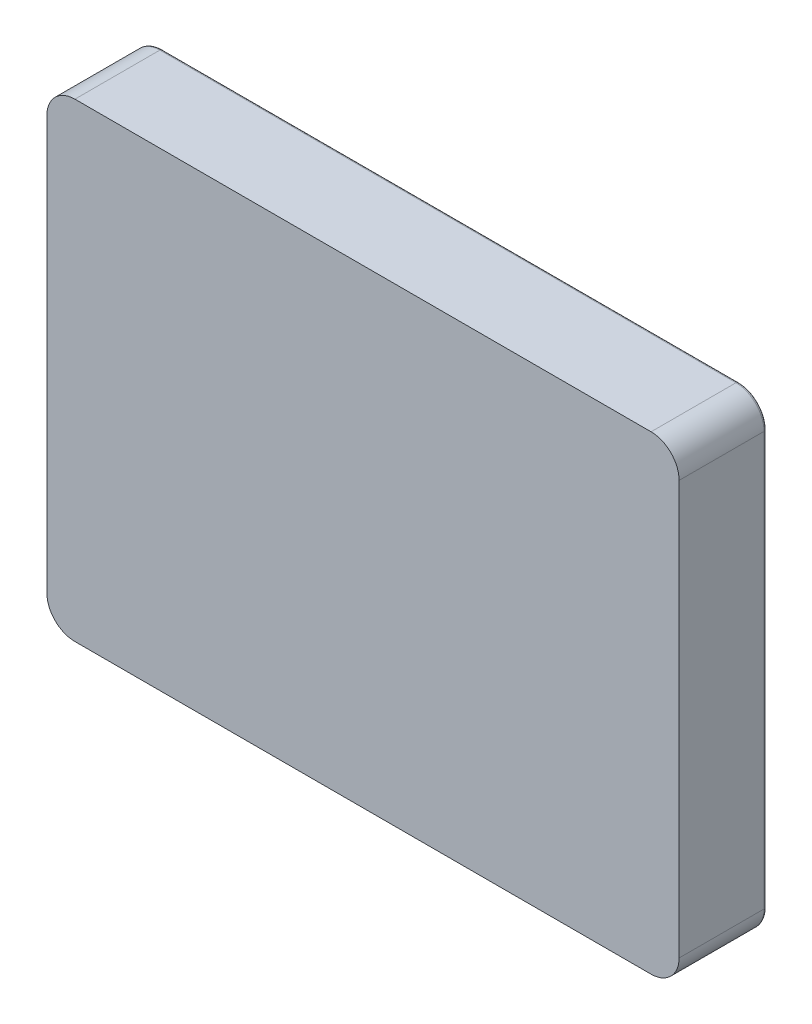
ISO-10303-21;
HEADER;
FILE_DESCRIPTION(('STEP AP214'),'2;1');
FILE_NAME('part.step','',(''),(''),'','','');
FILE_SCHEMA(('AUTOMOTIVE_DESIGN { 1 0 10303 214 1 1 1 1 }'));
ENDSEC;
DATA;
#1=APPLICATION_CONTEXT('core data for automotive mechanical design processes');
#2=APPLICATION_PROTOCOL_DEFINITION('international standard','automotive_design',2000,#1);
#3=PRODUCT_CONTEXT('',#1,'mechanical');
#4=PRODUCT('Part','Part','',(#3));
#5=PRODUCT_RELATED_PRODUCT_CATEGORY('part','',(#4));
#6=PRODUCT_DEFINITION_FORMATION('','',#4);
#7=PRODUCT_DEFINITION_CONTEXT('part definition',#1,'design');
#8=PRODUCT_DEFINITION('design','',#6,#7);
#9=PRODUCT_DEFINITION_SHAPE('','',#8);
#10=(LENGTH_UNIT() NAMED_UNIT(*) SI_UNIT(.MILLI.,.METRE.));
#11=(NAMED_UNIT(*) PLANE_ANGLE_UNIT() SI_UNIT($,.RADIAN.));
#12=(NAMED_UNIT(*) SI_UNIT($,.STERADIAN.) SOLID_ANGLE_UNIT());
#13=UNCERTAINTY_MEASURE_WITH_UNIT(LENGTH_MEASURE(1.E-05),#10,'distance_accuracy_value','');
#14=(GEOMETRIC_REPRESENTATION_CONTEXT(3) GLOBAL_UNCERTAINTY_ASSIGNED_CONTEXT((#13)) GLOBAL_UNIT_ASSIGNED_CONTEXT((#10,
#11,#12)) REPRESENTATION_CONTEXT('',''));
#15=CARTESIAN_POINT('',(0.,0.,0.));
#16=DIRECTION('',(0.,0.,1.));
#17=DIRECTION('',(1.,0.,0.));
#18=AXIS2_PLACEMENT_3D('',#15,#16,#17);
#19=CARTESIAN_POINT('',(-102.649,73.693,0.));
#20=DIRECTION('',(0.,0.,-1.));
#21=DIRECTION('',(-1.,0.,0.));
#22=AXIS2_PLACEMENT_3D('',#19,#20,#21);
#23=PLANE('',#22);
#24=DIRECTION('',(0.,1.,0.));
#25=VECTOR('',#24,1.);
#26=CARTESIAN_POINT('',(-111.649,73.693,0.));
#27=LINE('',#26,#25);
#28=CARTESIAN_POINT('',(-111.649,-73.6929999999999,0.));
#29=VERTEX_POINT('',#28);
#30=CARTESIAN_POINT('',(-111.649,73.6929999999999,0.));
#31=VERTEX_POINT('',#30);
#32=EDGE_CURVE('E234',#29,#31,#27,.T.);
#33=ORIENTED_EDGE('',*,*,#32,.T.);
#34=CARTESIAN_POINT('',(-102.649,73.693,0.));
#35=DIRECTION('',(0.,0.,-1.));
#36=DIRECTION('',(-1.,0.,0.));
#37=AXIS2_PLACEMENT_3D('',#34,#35,#36);
#38=CIRCLE('',#37,8.99999999999999);
#39=CARTESIAN_POINT('',(-102.649,82.693,0.));
#40=VERTEX_POINT('',#39);
#41=EDGE_CURVE('E236',#31,#40,#38,.T.);
#42=ORIENTED_EDGE('',*,*,#41,.T.);
#43=DIRECTION('',(1.,0.,0.));
#44=VECTOR('',#43,1.);
#45=CARTESIAN_POINT('',(-102.649,82.693,0.));
#46=LINE('',#45,#44);
#47=CARTESIAN_POINT('',(102.649,82.693,0.));
#48=VERTEX_POINT('',#47);
#49=EDGE_CURVE('E205',#40,#48,#46,.T.);
#50=ORIENTED_EDGE('',*,*,#49,.T.);
#51=CARTESIAN_POINT('',(102.649,73.693,0.));
#52=DIRECTION('',(0.,0.,-1.));
#53=DIRECTION('',(-1.,0.,0.));
#54=AXIS2_PLACEMENT_3D('',#51,#52,#53);
#55=CIRCLE('',#54,8.99999999999999);
#56=CARTESIAN_POINT('',(111.649,73.6929999999999,0.));
#57=VERTEX_POINT('',#56);
#58=EDGE_CURVE('E224',#48,#57,#55,.T.);
#59=ORIENTED_EDGE('',*,*,#58,.T.);
#60=DIRECTION('',(0.,1.,0.));
#61=VECTOR('',#60,1.);
#62=CARTESIAN_POINT('',(111.649,-73.6929999999999,0.));
#63=LINE('',#62,#61);
#64=CARTESIAN_POINT('',(111.649,-73.6929999999999,0.));
#65=VERTEX_POINT('',#64);
#66=EDGE_CURVE('E226',#57,#65,#63,.F.);
#67=ORIENTED_EDGE('',*,*,#66,.T.);
#68=CARTESIAN_POINT('',(102.649,-73.693,0.));
#69=DIRECTION('',(0.,0.,-1.));
#70=DIRECTION('',(-1.,0.,0.));
#71=AXIS2_PLACEMENT_3D('',#68,#69,#70);
#72=CIRCLE('',#71,8.99999999999999);
#73=CARTESIAN_POINT('',(102.649,-82.693,0.));
#74=VERTEX_POINT('',#73);
#75=EDGE_CURVE('E228',#65,#74,#72,.T.);
#76=ORIENTED_EDGE('',*,*,#75,.T.);
#77=DIRECTION('',(1.,0.,0.));
#78=VECTOR('',#77,1.);
#79=CARTESIAN_POINT('',(-102.649,-82.693,0.));
#80=LINE('',#79,#78);
#81=CARTESIAN_POINT('',(-102.649,-82.693,0.));
#82=VERTEX_POINT('',#81);
#83=EDGE_CURVE('E230',#74,#82,#80,.F.);
#84=ORIENTED_EDGE('',*,*,#83,.T.);
#85=CARTESIAN_POINT('',(-102.649,-73.693,0.));
#86=DIRECTION('',(0.,0.,-1.));
#87=DIRECTION('',(-1.,0.,0.));
#88=AXIS2_PLACEMENT_3D('',#85,#86,#87);
#89=CIRCLE('',#88,8.99999999999999);
#90=EDGE_CURVE('E232',#82,#29,#89,.T.);
#91=ORIENTED_EDGE('',*,*,#90,.T.);
#92=EDGE_LOOP('',(#33,#42,#50,#59,#67,#76,#84,#91));
#93=FACE_BOUND('',#92,.T.);
#94=DIRECTION('',(0.,1.,0.));
#95=VECTOR('',#94,1.);
#96=CARTESIAN_POINT('',(-102.963190284154,-76.496891090482,0.));
#97=LINE('',#96,#95);
#98=CARTESIAN_POINT('',(-102.963190284154,-76.496891090482,0.));
#99=VERTEX_POINT('',#98);
#100=CARTESIAN_POINT('',(-102.963190284154,76.4968910904821,0.));
#101=VERTEX_POINT('',#100);
#102=EDGE_CURVE('E171',#99,#101,#97,.T.);
#103=ORIENTED_EDGE('',*,*,#102,.F.);
#104=DIRECTION('',(1.,0.,0.));
#105=VECTOR('',#104,1.);
#106=CARTESIAN_POINT('',(-102.963190284154,-76.496891090482,0.));
#107=LINE('',#106,#105);
#108=CARTESIAN_POINT('',(102.963190284154,-76.496891090482,0.));
#109=VERTEX_POINT('',#108);
#110=EDGE_CURVE('E273',#99,#109,#107,.T.);
#111=ORIENTED_EDGE('',*,*,#110,.T.);
#112=DIRECTION('',(0.,1.,0.));
#113=VECTOR('',#112,1.);
#114=CARTESIAN_POINT('',(102.963190284154,-76.496891090482,0.));
#115=LINE('',#114,#113);
#116=CARTESIAN_POINT('',(102.963190284154,76.4968910904821,0.));
#117=VERTEX_POINT('',#116);
#118=EDGE_CURVE('E175',#109,#117,#115,.T.);
#119=ORIENTED_EDGE('',*,*,#118,.T.);
#120=DIRECTION('',(1.,0.,0.));
#121=VECTOR('',#120,1.);
#122=CARTESIAN_POINT('',(-102.963190284154,76.4968910904821,0.));
#123=LINE('',#122,#121);
#124=EDGE_CURVE('E281',#101,#117,#123,.T.);
#125=ORIENTED_EDGE('',*,*,#124,.F.);
#126=EDGE_LOOP('',(#103,#111,#119,#125));
#127=FACE_BOUND('',#126,.T.);
#128=ADVANCED_FACE('F36',(#93,#127),#23,.T.);
#129=CARTESIAN_POINT('',(-102.649,73.693,31.242));
#130=DIRECTION('',(0.,0.,-1.));
#131=DIRECTION('',(-1.,0.,0.));
#132=AXIS2_PLACEMENT_3D('',#129,#130,#131);
#133=CYLINDRICAL_SURFACE('',#132,9.99999999999999);
#134=DIRECTION('',(0.,0.,-1.));
#135=VECTOR('',#134,1.);
#136=CARTESIAN_POINT('',(-102.649,83.693,31.242));
#137=LINE('',#136,#135);
#138=CARTESIAN_POINT('',(-102.649,83.693,31.242));
#139=VERTEX_POINT('',#138);
#140=CARTESIAN_POINT('',(-102.649,83.693,1.00000000000001));
#141=VERTEX_POINT('',#140);
#142=EDGE_CURVE('E201',#139,#141,#137,.T.);
#143=ORIENTED_EDGE('',*,*,#142,.T.);
#144=CARTESIAN_POINT('',(-102.649,73.693,1.));
#145=DIRECTION('',(0.,0.,-1.));
#146=DIRECTION('',(-1.,0.,0.));
#147=AXIS2_PLACEMENT_3D('',#144,#145,#146);
#148=CIRCLE('',#147,9.99999999999999);
#149=CARTESIAN_POINT('',(-112.649,73.6929999999999,1.00000000000001));
#150=VERTEX_POINT('',#149);
#151=EDGE_CURVE('E239',#141,#150,#148,.F.);
#152=ORIENTED_EDGE('',*,*,#151,.T.);
#153=DIRECTION('',(0.,0.,-1.));
#154=VECTOR('',#153,1.);
#155=CARTESIAN_POINT('',(-112.649,73.6929999999999,31.242));
#156=LINE('',#155,#154);
#157=CARTESIAN_POINT('',(-112.649,73.6929999999999,31.242));
#158=VERTEX_POINT('',#157);
#159=EDGE_CURVE('E202',#158,#150,#156,.T.);
#160=ORIENTED_EDGE('',*,*,#159,.F.);
#161=CARTESIAN_POINT('',(-102.649,73.693,31.242));
#162=DIRECTION('',(0.,0.,-1.));
#163=DIRECTION('',(-1.,0.,0.));
#164=AXIS2_PLACEMENT_3D('',#161,#162,#163);
#165=CIRCLE('',#164,9.99999999999999);
#166=EDGE_CURVE('E176',#158,#139,#165,.T.);
#167=ORIENTED_EDGE('',*,*,#166,.T.);
#168=EDGE_LOOP('',(#143,#152,#160,#167));
#169=FACE_BOUND('',#168,.T.);
#170=ADVANCED_FACE('F297',(#169),#133,.T.);
#171=CARTESIAN_POINT('',(-112.649,-73.6929999999999,31.242));
#172=DIRECTION('',(-1.,0.,0.));
#173=DIRECTION('',(0.,0.,1.));
#174=AXIS2_PLACEMENT_3D('',#171,#172,#173);
#175=PLANE('',#174);
#176=ORIENTED_EDGE('',*,*,#159,.T.);
#177=DIRECTION('',(0.,1.,0.));
#178=VECTOR('',#177,1.);
#179=CARTESIAN_POINT('',(-112.649,-73.6929999999999,1.));
#180=LINE('',#179,#178);
#181=CARTESIAN_POINT('',(-112.649,-73.6929999999999,1.00000000000001));
#182=VERTEX_POINT('',#181);
#183=EDGE_CURVE('E242',#150,#182,#180,.F.);
#184=ORIENTED_EDGE('',*,*,#183,.T.);
#185=DIRECTION('',(0.,0.,-1.));
#186=VECTOR('',#185,1.);
#187=CARTESIAN_POINT('',(-112.649,-73.6929999999999,31.242));
#188=LINE('',#187,#186);
#189=CARTESIAN_POINT('',(-112.649,-73.6929999999999,31.242));
#190=VERTEX_POINT('',#189);
#191=EDGE_CURVE('E206',#190,#182,#188,.T.);
#192=ORIENTED_EDGE('',*,*,#191,.F.);
#193=DIRECTION('',(0.,1.,0.));
#194=VECTOR('',#193,1.);
#195=CARTESIAN_POINT('',(-112.649,-73.6929999999999,31.242));
#196=LINE('',#195,#194);
#197=EDGE_CURVE('E198',#190,#158,#196,.T.);
#198=ORIENTED_EDGE('',*,*,#197,.T.);
#199=EDGE_LOOP('',(#176,#184,#192,#198));
#200=FACE_BOUND('',#199,.T.);
#201=ADVANCED_FACE('F303',(#200),#175,.T.);
#202=CARTESIAN_POINT('',(-102.649,-73.693,31.242));
#203=DIRECTION('',(0.,0.,-1.));
#204=DIRECTION('',(-1.,0.,0.));
#205=AXIS2_PLACEMENT_3D('',#202,#203,#204);
#206=CYLINDRICAL_SURFACE('',#205,9.99999999999999);
#207=ORIENTED_EDGE('',*,*,#191,.T.);
#208=CARTESIAN_POINT('',(-102.649,-73.693,1.));
#209=DIRECTION('',(0.,0.,-1.));
#210=DIRECTION('',(-1.,0.,0.));
#211=AXIS2_PLACEMENT_3D('',#208,#209,#210);
#212=CIRCLE('',#211,9.99999999999999);
#213=CARTESIAN_POINT('',(-102.649,-83.693,1.00000000000001));
#214=VERTEX_POINT('',#213);
#215=EDGE_CURVE('E244',#182,#214,#212,.F.);
#216=ORIENTED_EDGE('',*,*,#215,.T.);
#217=DIRECTION('',(0.,0.,-1.));
#218=VECTOR('',#217,1.);
#219=CARTESIAN_POINT('',(-102.649,-83.693,31.242));
#220=LINE('',#219,#218);
#221=CARTESIAN_POINT('',(-102.649,-83.693,31.242));
#222=VERTEX_POINT('',#221);
#223=EDGE_CURVE('E209',#222,#214,#220,.T.);
#224=ORIENTED_EDGE('',*,*,#223,.F.);
#225=CARTESIAN_POINT('',(-102.649,-73.693,31.242));
#226=DIRECTION('',(0.,0.,1.));
#227=DIRECTION('',(1.,0.,0.));
#228=AXIS2_PLACEMENT_3D('',#225,#226,#227);
#229=CIRCLE('',#228,9.99999999999999);
#230=EDGE_CURVE('E196',#190,#222,#229,.T.);
#231=ORIENTED_EDGE('',*,*,#230,.F.);
#232=EDGE_LOOP('',(#207,#216,#224,#231));
#233=FACE_BOUND('',#232,.T.);
#234=ADVANCED_FACE('F312',(#233),#206,.T.);
#235=CARTESIAN_POINT('',(-102.649,-83.693,31.242));
#236=DIRECTION('',(0.,1.,0.));
#237=DIRECTION('',(0.,0.,1.));
#238=AXIS2_PLACEMENT_3D('',#235,#236,#237);
#239=PLANE('',#238);
#240=ORIENTED_EDGE('',*,*,#223,.T.);
#241=DIRECTION('',(1.,0.,0.));
#242=VECTOR('',#241,1.);
#243=CARTESIAN_POINT('',(102.649,-83.693,1.));
#244=LINE('',#243,#242);
#245=CARTESIAN_POINT('',(102.649,-83.693,1.00000000000001));
#246=VERTEX_POINT('',#245);
#247=EDGE_CURVE('E246',#214,#246,#244,.T.);
#248=ORIENTED_EDGE('',*,*,#247,.T.);
#249=DIRECTION('',(0.,0.,-1.));
#250=VECTOR('',#249,1.);
#251=CARTESIAN_POINT('',(102.649,-83.693,31.242));
#252=LINE('',#251,#250);
#253=CARTESIAN_POINT('',(102.649,-83.693,31.242));
#254=VERTEX_POINT('',#253);
#255=EDGE_CURVE('E212',#254,#246,#252,.T.);
#256=ORIENTED_EDGE('',*,*,#255,.F.);
#257=DIRECTION('',(1.,0.,0.));
#258=VECTOR('',#257,1.);
#259=CARTESIAN_POINT('',(-102.649,-83.693,31.242));
#260=LINE('',#259,#258);
#261=EDGE_CURVE('E194',#222,#254,#260,.T.);
#262=ORIENTED_EDGE('',*,*,#261,.F.);
#263=EDGE_LOOP('',(#240,#248,#256,#262));
#264=FACE_BOUND('',#263,.T.);
#265=ADVANCED_FACE('F316',(#264),#239,.F.);
#266=CARTESIAN_POINT('',(102.649,-73.693,31.242));
#267=DIRECTION('',(0.,0.,-1.));
#268=DIRECTION('',(-1.,0.,0.));
#269=AXIS2_PLACEMENT_3D('',#266,#267,#268);
#270=CYLINDRICAL_SURFACE('',#269,9.99999999999999);
#271=ORIENTED_EDGE('',*,*,#255,.T.);
#272=CARTESIAN_POINT('',(102.649,-73.693,1.));
#273=DIRECTION('',(0.,0.,-1.));
#274=DIRECTION('',(-1.,0.,0.));
#275=AXIS2_PLACEMENT_3D('',#272,#273,#274);
#276=CIRCLE('',#275,9.99999999999999);
#277=CARTESIAN_POINT('',(112.649,-73.6929999999999,1.00000000000001));
#278=VERTEX_POINT('',#277);
#279=EDGE_CURVE('E248',#246,#278,#276,.F.);
#280=ORIENTED_EDGE('',*,*,#279,.T.);
#281=DIRECTION('',(0.,0.,-1.));
#282=VECTOR('',#281,1.);
#283=CARTESIAN_POINT('',(112.649,-73.6929999999999,31.242));
#284=LINE('',#283,#282);
#285=CARTESIAN_POINT('',(112.649,-73.6929999999999,31.242));
#286=VERTEX_POINT('',#285);
#287=EDGE_CURVE('E215',#286,#278,#284,.T.);
#288=ORIENTED_EDGE('',*,*,#287,.F.);
#289=CARTESIAN_POINT('',(102.649,-73.693,31.242));
#290=DIRECTION('',(0.,0.,1.));
#291=DIRECTION('',(1.,0.,0.));
#292=AXIS2_PLACEMENT_3D('',#289,#290,#291);
#293=CIRCLE('',#292,9.99999999999999);
#294=EDGE_CURVE('E192',#254,#286,#293,.T.);
#295=ORIENTED_EDGE('',*,*,#294,.F.);
#296=EDGE_LOOP('',(#271,#280,#288,#295));
#297=FACE_BOUND('',#296,.T.);
#298=ADVANCED_FACE('F320',(#297),#270,.T.);
#299=CARTESIAN_POINT('',(112.649,-73.6929999999999,31.242));
#300=DIRECTION('',(-1.,0.,0.));
#301=DIRECTION('',(0.,0.,1.));
#302=AXIS2_PLACEMENT_3D('',#299,#300,#301);
#303=PLANE('',#302);
#304=ORIENTED_EDGE('',*,*,#287,.T.);
#305=DIRECTION('',(0.,1.,0.));
#306=VECTOR('',#305,1.);
#307=CARTESIAN_POINT('',(112.649,73.6929999999999,1.));
#308=LINE('',#307,#306);
#309=CARTESIAN_POINT('',(112.649,73.6929999999999,1.00000000000001));
#310=VERTEX_POINT('',#309);
#311=EDGE_CURVE('E60',#278,#310,#308,.T.);
#312=ORIENTED_EDGE('',*,*,#311,.T.);
#313=DIRECTION('',(0.,0.,-1.));
#314=VECTOR('',#313,1.);
#315=CARTESIAN_POINT('',(112.649,73.6929999999999,31.242));
#316=LINE('',#315,#314);
#317=CARTESIAN_POINT('',(112.649,73.6929999999999,31.242));
#318=VERTEX_POINT('',#317);
#319=EDGE_CURVE('E217',#318,#310,#316,.T.);
#320=ORIENTED_EDGE('',*,*,#319,.F.);
#321=DIRECTION('',(0.,1.,0.));
#322=VECTOR('',#321,1.);
#323=CARTESIAN_POINT('',(112.649,-73.6929999999999,31.242));
#324=LINE('',#323,#322);
#325=EDGE_CURVE('E190',#286,#318,#324,.T.);
#326=ORIENTED_EDGE('',*,*,#325,.F.);
#327=EDGE_LOOP('',(#304,#312,#320,#326));
#328=FACE_BOUND('',#327,.T.);
#329=ADVANCED_FACE('F324',(#328),#303,.F.);
#330=CARTESIAN_POINT('',(102.649,73.693,31.242));
#331=DIRECTION('',(0.,0.,-1.));
#332=DIRECTION('',(-1.,0.,0.));
#333=AXIS2_PLACEMENT_3D('',#330,#331,#332);
#334=CYLINDRICAL_SURFACE('',#333,9.99999999999999);
#335=ORIENTED_EDGE('',*,*,#319,.T.);
#336=CARTESIAN_POINT('',(102.649,73.693,1.));
#337=DIRECTION('',(0.,0.,-1.));
#338=DIRECTION('',(-1.,0.,0.));
#339=AXIS2_PLACEMENT_3D('',#336,#337,#338);
#340=CIRCLE('',#339,9.99999999999999);
#341=CARTESIAN_POINT('',(102.649,83.693,1.00000000000001));
#342=VERTEX_POINT('',#341);
#343=EDGE_CURVE('E45',#310,#342,#340,.F.);
#344=ORIENTED_EDGE('',*,*,#343,.T.);
#345=DIRECTION('',(0.,0.,-1.));
#346=VECTOR('',#345,1.);
#347=CARTESIAN_POINT('',(102.649,83.693,31.242));
#348=LINE('',#347,#346);
#349=CARTESIAN_POINT('',(102.649,83.693,31.242));
#350=VERTEX_POINT('',#349);
#351=EDGE_CURVE('E219',#350,#342,#348,.T.);
#352=ORIENTED_EDGE('',*,*,#351,.F.);
#353=CARTESIAN_POINT('',(102.649,73.693,31.242));
#354=DIRECTION('',(0.,0.,1.));
#355=DIRECTION('',(1.,0.,0.));
#356=AXIS2_PLACEMENT_3D('',#353,#354,#355);
#357=CIRCLE('',#356,9.99999999999999);
#358=EDGE_CURVE('E188',#318,#350,#357,.T.);
#359=ORIENTED_EDGE('',*,*,#358,.F.);
#360=EDGE_LOOP('',(#335,#344,#352,#359));
#361=FACE_BOUND('',#360,.T.);
#362=ADVANCED_FACE('F328',(#361),#334,.T.);
#363=CARTESIAN_POINT('',(-102.649,83.693,31.242));
#364=DIRECTION('',(0.,1.,0.));
#365=DIRECTION('',(0.,0.,1.));
#366=AXIS2_PLACEMENT_3D('',#363,#364,#365);
#367=PLANE('',#366);
#368=ORIENTED_EDGE('',*,*,#351,.T.);
#369=DIRECTION('',(1.,0.,0.));
#370=VECTOR('',#369,1.);
#371=CARTESIAN_POINT('',(-102.649,83.693,1.));
#372=LINE('',#371,#370);
#373=EDGE_CURVE('E11',#342,#141,#372,.F.);
#374=ORIENTED_EDGE('',*,*,#373,.T.);
#375=ORIENTED_EDGE('',*,*,#142,.F.);
#376=DIRECTION('',(1.,0.,0.));
#377=VECTOR('',#376,1.);
#378=CARTESIAN_POINT('',(-102.649,83.693,31.242));
#379=LINE('',#378,#377);
#380=EDGE_CURVE('E180',#139,#350,#379,.T.);
#381=ORIENTED_EDGE('',*,*,#380,.T.);
#382=EDGE_LOOP('',(#368,#374,#375,#381));
#383=FACE_BOUND('',#382,.T.);
#384=ADVANCED_FACE('F331',(#383),#367,.T.);
#385=CARTESIAN_POINT('',(-102.649,73.693,31.242));
#386=DIRECTION('',(0.,0.,-1.));
#387=DIRECTION('',(-1.,0.,0.));
#388=AXIS2_PLACEMENT_3D('',#385,#386,#387);
#389=PLANE('',#388);
#390=ORIENTED_EDGE('',*,*,#166,.F.);
#391=ORIENTED_EDGE('',*,*,#197,.F.);
#392=ORIENTED_EDGE('',*,*,#230,.T.);
#393=ORIENTED_EDGE('',*,*,#261,.T.);
#394=ORIENTED_EDGE('',*,*,#294,.T.);
#395=ORIENTED_EDGE('',*,*,#325,.T.);
#396=ORIENTED_EDGE('',*,*,#358,.T.);
#397=ORIENTED_EDGE('',*,*,#380,.F.);
#398=EDGE_LOOP('',(#390,#391,#392,#393,#394,#395,#396,#397));
#399=FACE_BOUND('',#398,.T.);
#400=ADVANCED_FACE('F308',(#399),#389,.F.);
#401=CARTESIAN_POINT('',(-102.963190284154,-76.496891090482,1.));
#402=DIRECTION('',(0.,1.,0.));
#403=DIRECTION('',(0.,0.,1.));
#404=AXIS2_PLACEMENT_3D('',#401,#402,#403);
#405=PLANE('',#404);
#406=ORIENTED_EDGE('',*,*,#110,.F.);
#407=DIRECTION('',(0.,0.,-1.));
#408=VECTOR('',#407,1.);
#409=CARTESIAN_POINT('',(-102.963190284154,-76.496891090482,1.));
#410=LINE('',#409,#408);
#411=CARTESIAN_POINT('',(-102.963190284154,-76.496891090482,1.));
#412=VERTEX_POINT('',#411);
#413=EDGE_CURVE('E170',#412,#99,#410,.T.);
#414=ORIENTED_EDGE('',*,*,#413,.F.);
#415=DIRECTION('',(1.,0.,0.));
#416=VECTOR('',#415,1.);
#417=CARTESIAN_POINT('',(-102.963190284154,-76.496891090482,1.));
#418=LINE('',#417,#416);
#419=CARTESIAN_POINT('',(102.963190284154,-76.496891090482,1.));
#420=VERTEX_POINT('',#419);
#421=EDGE_CURVE('E156',#412,#420,#418,.T.);
#422=ORIENTED_EDGE('',*,*,#421,.T.);
#423=DIRECTION('',(0.,0.,-1.));
#424=VECTOR('',#423,1.);
#425=CARTESIAN_POINT('',(102.963190284154,-76.496891090482,1.));
#426=LINE('',#425,#424);
#427=EDGE_CURVE('E167',#420,#109,#426,.T.);
#428=ORIENTED_EDGE('',*,*,#427,.T.);
#429=EDGE_LOOP('',(#406,#414,#422,#428));
#430=FACE_BOUND('',#429,.T.);
#431=ADVANCED_FACE('F166',(#430),#405,.T.);
#432=CARTESIAN_POINT('',(102.963190284154,-76.496891090482,1.));
#433=DIRECTION('',(-1.,0.,0.));
#434=DIRECTION('',(0.,0.,1.));
#435=AXIS2_PLACEMENT_3D('',#432,#433,#434);
#436=PLANE('',#435);
#437=ORIENTED_EDGE('',*,*,#118,.F.);
#438=ORIENTED_EDGE('',*,*,#427,.F.);
#439=DIRECTION('',(0.,1.,0.));
#440=VECTOR('',#439,1.);
#441=CARTESIAN_POINT('',(102.963190284154,-76.496891090482,1.));
#442=LINE('',#441,#440);
#443=CARTESIAN_POINT('',(102.963190284154,76.4968910904821,1.));
#444=VERTEX_POINT('',#443);
#445=EDGE_CURVE('E152',#420,#444,#442,.T.);
#446=ORIENTED_EDGE('',*,*,#445,.T.);
#447=DIRECTION('',(0.,0.,-1.));
#448=VECTOR('',#447,1.);
#449=CARTESIAN_POINT('',(102.963190284154,76.4968910904821,1.));
#450=LINE('',#449,#448);
#451=EDGE_CURVE('E177',#444,#117,#450,.T.);
#452=ORIENTED_EDGE('',*,*,#451,.T.);
#453=EDGE_LOOP('',(#437,#438,#446,#452));
#454=FACE_BOUND('',#453,.T.);
#455=ADVANCED_FACE('F173',(#454),#436,.T.);
#456=CARTESIAN_POINT('',(-102.963190284154,76.4968910904821,1.));
#457=DIRECTION('',(0.,1.,0.));
#458=DIRECTION('',(0.,0.,1.));
#459=AXIS2_PLACEMENT_3D('',#456,#457,#458);
#460=PLANE('',#459);
#461=ORIENTED_EDGE('',*,*,#124,.T.);
#462=ORIENTED_EDGE('',*,*,#451,.F.);
#463=DIRECTION('',(1.,0.,0.));
#464=VECTOR('',#463,1.);
#465=CARTESIAN_POINT('',(-102.963190284154,76.4968910904821,1.));
#466=LINE('',#465,#464);
#467=CARTESIAN_POINT('',(-102.963190284154,76.4968910904821,1.));
#468=VERTEX_POINT('',#467);
#469=EDGE_CURVE('E159',#468,#444,#466,.T.);
#470=ORIENTED_EDGE('',*,*,#469,.F.);
#471=DIRECTION('',(0.,0.,-1.));
#472=VECTOR('',#471,1.);
#473=CARTESIAN_POINT('',(-102.963190284154,76.4968910904821,1.));
#474=LINE('',#473,#472);
#475=EDGE_CURVE('E182',#468,#101,#474,.T.);
#476=ORIENTED_EDGE('',*,*,#475,.T.);
#477=EDGE_LOOP('',(#461,#462,#470,#476));
#478=FACE_BOUND('',#477,.T.);
#479=ADVANCED_FACE('F292',(#478),#460,.F.);
#480=CARTESIAN_POINT('',(-102.963190284154,-76.496891090482,1.));
#481=DIRECTION('',(-1.,0.,0.));
#482=DIRECTION('',(0.,0.,1.));
#483=AXIS2_PLACEMENT_3D('',#480,#481,#482);
#484=PLANE('',#483);
#485=ORIENTED_EDGE('',*,*,#102,.T.);
#486=ORIENTED_EDGE('',*,*,#475,.F.);
#487=DIRECTION('',(0.,1.,0.));
#488=VECTOR('',#487,1.);
#489=CARTESIAN_POINT('',(-102.963190284154,-76.496891090482,1.));
#490=LINE('',#489,#488);
#491=EDGE_CURVE('E284',#412,#468,#490,.T.);
#492=ORIENTED_EDGE('',*,*,#491,.F.);
#493=ORIENTED_EDGE('',*,*,#413,.T.);
#494=EDGE_LOOP('',(#485,#486,#492,#493));
#495=FACE_BOUND('',#494,.T.);
#496=ADVANCED_FACE('F295',(#495),#484,.F.);
#497=CARTESIAN_POINT('',(0.,0.,1.));
#498=DIRECTION('',(0.,0.,1.));
#499=DIRECTION('',(1.,0.,0.));
#500=AXIS2_PLACEMENT_3D('',#497,#498,#499);
#501=PLANE('',#500);
#502=ORIENTED_EDGE('',*,*,#421,.F.);
#503=ORIENTED_EDGE('',*,*,#491,.T.);
#504=ORIENTED_EDGE('',*,*,#469,.T.);
#505=ORIENTED_EDGE('',*,*,#445,.F.);
#506=EDGE_LOOP('',(#502,#503,#504,#505));
#507=FACE_BOUND('',#506,.T.);
#508=ADVANCED_FACE('F154',(#507),#501,.F.);
#509=CARTESIAN_POINT('',(102.649,-73.693,1.));
#510=DIRECTION('',(0.,0.,-1.));
#511=DIRECTION('',(-1.,0.,0.));
#512=AXIS2_PLACEMENT_3D('',#509,#510,#511);
#513=TOROIDAL_SURFACE('',#512,8.99999999999999,1.);
#514=CARTESIAN_POINT('',(111.649,-73.6929999999999,1.));
#515=DIRECTION('',(0.,1.,0.));
#516=DIRECTION('',(-1.,0.,0.));
#517=AXIS2_PLACEMENT_3D('',#514,#515,#516);
#518=CIRCLE('',#517,1.);
#519=EDGE_CURVE('E267',#278,#65,#518,.T.);
#520=ORIENTED_EDGE('',*,*,#519,.F.);
#521=ORIENTED_EDGE('',*,*,#279,.F.);
#522=CARTESIAN_POINT('',(102.649,-82.693,1.));
#523=DIRECTION('',(-1.,0.,0.));
#524=DIRECTION('',(0.,0.,1.));
#525=AXIS2_PLACEMENT_3D('',#522,#523,#524);
#526=CIRCLE('',#525,1.);
#527=EDGE_CURVE('E40',#74,#246,#526,.T.);
#528=ORIENTED_EDGE('',*,*,#527,.F.);
#529=ORIENTED_EDGE('',*,*,#75,.F.);
#530=EDGE_LOOP('',(#520,#521,#528,#529));
#531=FACE_BOUND('',#530,.T.);
#532=ADVANCED_FACE('F38',(#531),#513,.T.);
#533=CARTESIAN_POINT('',(-102.649,-82.693,1.));
#534=DIRECTION('',(-1.,0.,0.));
#535=DIRECTION('',(0.,0.,1.));
#536=AXIS2_PLACEMENT_3D('',#533,#534,#535);
#537=CYLINDRICAL_SURFACE('',#536,1.);
#538=ORIENTED_EDGE('',*,*,#527,.T.);
#539=ORIENTED_EDGE('',*,*,#247,.F.);
#540=CARTESIAN_POINT('',(-102.649,-82.693,1.));
#541=DIRECTION('',(-1.,0.,0.));
#542=DIRECTION('',(0.,-1.,0.));
#543=AXIS2_PLACEMENT_3D('',#540,#541,#542);
#544=CIRCLE('',#543,1.);
#545=EDGE_CURVE('E265',#82,#214,#544,.T.);
#546=ORIENTED_EDGE('',*,*,#545,.F.);
#547=ORIENTED_EDGE('',*,*,#83,.F.);
#548=EDGE_LOOP('',(#538,#539,#546,#547));
#549=FACE_BOUND('',#548,.T.);
#550=ADVANCED_FACE('F357',(#549),#537,.T.);
#551=CARTESIAN_POINT('',(111.649,-73.6929999999999,1.));
#552=DIRECTION('',(0.,-1.,0.));
#553=DIRECTION('',(0.,0.,-1.));
#554=AXIS2_PLACEMENT_3D('',#551,#552,#553);
#555=CYLINDRICAL_SURFACE('',#554,1.);
#556=ORIENTED_EDGE('',*,*,#519,.T.);
#557=ORIENTED_EDGE('',*,*,#66,.F.);
#558=CARTESIAN_POINT('',(111.649,73.6929999999999,1.));
#559=DIRECTION('',(0.,1.,0.));
#560=DIRECTION('',(0.,0.,1.));
#561=AXIS2_PLACEMENT_3D('',#558,#559,#560);
#562=CIRCLE('',#561,1.);
#563=EDGE_CURVE('E262',#310,#57,#562,.T.);
#564=ORIENTED_EDGE('',*,*,#563,.F.);
#565=ORIENTED_EDGE('',*,*,#311,.F.);
#566=EDGE_LOOP('',(#556,#557,#564,#565));
#567=FACE_BOUND('',#566,.T.);
#568=ADVANCED_FACE('F354',(#567),#555,.T.);
#569=CARTESIAN_POINT('',(-102.649,-73.693,1.));
#570=DIRECTION('',(0.,0.,-1.));
#571=DIRECTION('',(-1.,0.,0.));
#572=AXIS2_PLACEMENT_3D('',#569,#570,#571);
#573=TOROIDAL_SURFACE('',#572,8.99999999999999,1.);
#574=ORIENTED_EDGE('',*,*,#545,.T.);
#575=ORIENTED_EDGE('',*,*,#215,.F.);
#576=CARTESIAN_POINT('',(-111.649,-73.6929999999999,1.));
#577=DIRECTION('',(0.,1.,0.));
#578=DIRECTION('',(0.,0.,1.));
#579=AXIS2_PLACEMENT_3D('',#576,#577,#578);
#580=CIRCLE('',#579,1.);
#581=EDGE_CURVE('E259',#29,#182,#580,.T.);
#582=ORIENTED_EDGE('',*,*,#581,.F.);
#583=ORIENTED_EDGE('',*,*,#90,.F.);
#584=EDGE_LOOP('',(#574,#575,#582,#583));
#585=FACE_BOUND('',#584,.T.);
#586=ADVANCED_FACE('F350',(#585),#573,.T.);
#587=CARTESIAN_POINT('',(102.649,73.693,1.));
#588=DIRECTION('',(0.,0.,-1.));
#589=DIRECTION('',(-1.,0.,0.));
#590=AXIS2_PLACEMENT_3D('',#587,#588,#589);
#591=TOROIDAL_SURFACE('',#590,8.99999999999999,1.);
#592=ORIENTED_EDGE('',*,*,#563,.T.);
#593=ORIENTED_EDGE('',*,*,#58,.F.);
#594=CARTESIAN_POINT('',(102.649,82.693,1.));
#595=DIRECTION('',(-1.,0.,0.));
#596=DIRECTION('',(0.,-1.,0.));
#597=AXIS2_PLACEMENT_3D('',#594,#595,#596);
#598=CIRCLE('',#597,1.);
#599=EDGE_CURVE('E256',#342,#48,#598,.T.);
#600=ORIENTED_EDGE('',*,*,#599,.F.);
#601=ORIENTED_EDGE('',*,*,#343,.F.);
#602=EDGE_LOOP('',(#592,#593,#600,#601));
#603=FACE_BOUND('',#602,.T.);
#604=ADVANCED_FACE('F346',(#603),#591,.T.);
#605=CARTESIAN_POINT('',(-111.649,73.693,1.));
#606=DIRECTION('',(0.,1.,0.));
#607=DIRECTION('',(0.,0.,1.));
#608=AXIS2_PLACEMENT_3D('',#605,#606,#607);
#609=CYLINDRICAL_SURFACE('',#608,1.);
#610=ORIENTED_EDGE('',*,*,#581,.T.);
#611=ORIENTED_EDGE('',*,*,#183,.F.);
#612=CARTESIAN_POINT('',(-111.649,73.6929999999999,1.));
#613=DIRECTION('',(0.,1.,0.));
#614=DIRECTION('',(-1.,0.,0.));
#615=AXIS2_PLACEMENT_3D('',#612,#613,#614);
#616=CIRCLE('',#615,1.);
#617=EDGE_CURVE('E254',#31,#150,#616,.T.);
#618=ORIENTED_EDGE('',*,*,#617,.F.);
#619=ORIENTED_EDGE('',*,*,#32,.F.);
#620=EDGE_LOOP('',(#610,#611,#618,#619));
#621=FACE_BOUND('',#620,.T.);
#622=ADVANCED_FACE('F342',(#621),#609,.T.);
#623=CARTESIAN_POINT('',(-102.649,82.693,1.));
#624=DIRECTION('',(1.,0.,0.));
#625=DIRECTION('',(0.,0.,-1.));
#626=AXIS2_PLACEMENT_3D('',#623,#624,#625);
#627=CYLINDRICAL_SURFACE('',#626,1.);
#628=ORIENTED_EDGE('',*,*,#599,.T.);
#629=ORIENTED_EDGE('',*,*,#49,.F.);
#630=CARTESIAN_POINT('',(-102.649,82.693,1.));
#631=DIRECTION('',(-1.,0.,0.));
#632=DIRECTION('',(0.,0.,1.));
#633=AXIS2_PLACEMENT_3D('',#630,#631,#632);
#634=CIRCLE('',#633,1.);
#635=EDGE_CURVE('E252',#141,#40,#634,.T.);
#636=ORIENTED_EDGE('',*,*,#635,.F.);
#637=ORIENTED_EDGE('',*,*,#373,.F.);
#638=EDGE_LOOP('',(#628,#629,#636,#637));
#639=FACE_BOUND('',#638,.T.);
#640=ADVANCED_FACE('F338',(#639),#627,.T.);
#641=CARTESIAN_POINT('',(-102.649,73.693,1.));
#642=DIRECTION('',(0.,0.,-1.));
#643=DIRECTION('',(-1.,0.,0.));
#644=AXIS2_PLACEMENT_3D('',#641,#642,#643);
#645=TOROIDAL_SURFACE('',#644,8.99999999999999,1.);
#646=ORIENTED_EDGE('',*,*,#617,.T.);
#647=ORIENTED_EDGE('',*,*,#151,.F.);
#648=ORIENTED_EDGE('',*,*,#635,.T.);
#649=ORIENTED_EDGE('',*,*,#41,.F.);
#650=EDGE_LOOP('',(#646,#647,#648,#649));
#651=FACE_BOUND('',#650,.T.);
#652=ADVANCED_FACE('F335',(#651),#645,.T.);
#653=CLOSED_SHELL('',(#128,#170,#201,#234,#265,#298,#329,#362,#384,#400,#431,#455,#479,#496,
#508,#532,#550,#568,#586,#604,#622,#640,#652));
#654=MANIFOLD_SOLID_BREP('B2',#653);
#655=ADVANCED_BREP_SHAPE_REPRESENTATION('',(#18,#654),#14);
#656=SHAPE_DEFINITION_REPRESENTATION(#9,#655);
ENDSEC;
END-ISO-10303-21;
